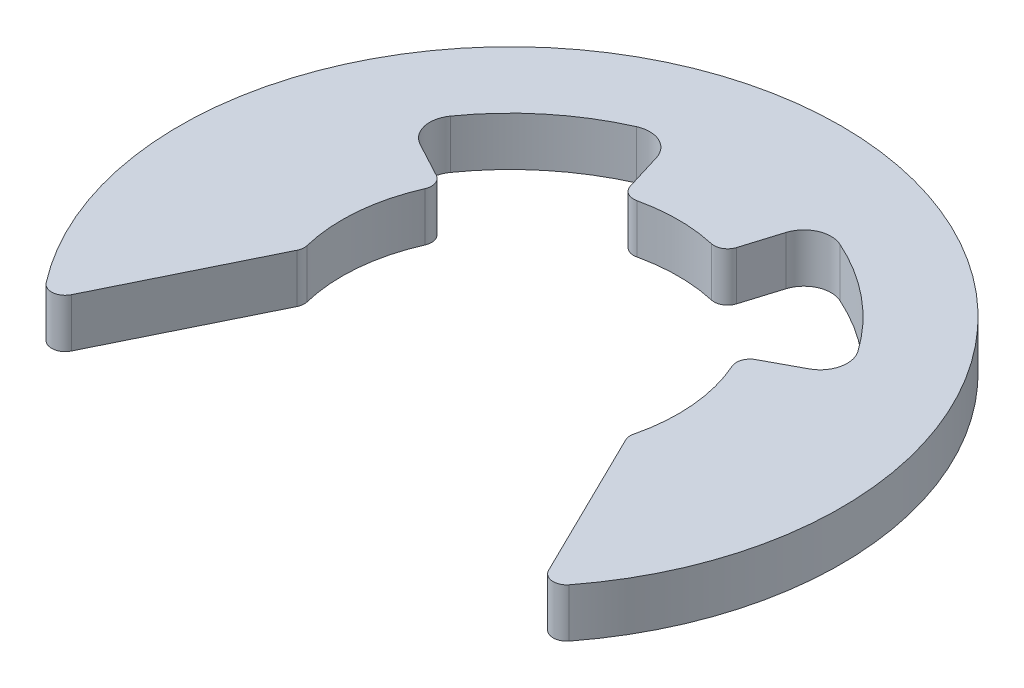
ISO-10303-21;
HEADER;
FILE_DESCRIPTION(('STEP AP214'),'2;1');
FILE_NAME('part.step','',(''),(''),'','','');
FILE_SCHEMA(('AUTOMOTIVE_DESIGN { 1 0 10303 214 1 1 1 1 }'));
ENDSEC;
DATA;
#1=APPLICATION_CONTEXT('core data for automotive mechanical design processes');
#2=APPLICATION_PROTOCOL_DEFINITION('international standard','automotive_design',2000,#1);
#3=PRODUCT_CONTEXT('',#1,'mechanical');
#4=PRODUCT('Part','Part','',(#3));
#5=PRODUCT_RELATED_PRODUCT_CATEGORY('part','',(#4));
#6=PRODUCT_DEFINITION_FORMATION('','',#4);
#7=PRODUCT_DEFINITION_CONTEXT('part definition',#1,'design');
#8=PRODUCT_DEFINITION('design','',#6,#7);
#9=PRODUCT_DEFINITION_SHAPE('','',#8);
#10=(LENGTH_UNIT() NAMED_UNIT(*) SI_UNIT(.MILLI.,.METRE.));
#11=(NAMED_UNIT(*) PLANE_ANGLE_UNIT() SI_UNIT($,.RADIAN.));
#12=(NAMED_UNIT(*) SI_UNIT($,.STERADIAN.) SOLID_ANGLE_UNIT());
#13=UNCERTAINTY_MEASURE_WITH_UNIT(LENGTH_MEASURE(1.E-05),#10,'distance_accuracy_value','');
#14=(GEOMETRIC_REPRESENTATION_CONTEXT(3) GLOBAL_UNCERTAINTY_ASSIGNED_CONTEXT((#13)) GLOBAL_UNIT_ASSIGNED_CONTEXT((#10,
#11,#12)) REPRESENTATION_CONTEXT('',''));
#15=CARTESIAN_POINT('',(0.,0.,0.));
#16=DIRECTION('',(0.,0.,1.));
#17=DIRECTION('',(1.,0.,0.));
#18=AXIS2_PLACEMENT_3D('',#15,#16,#17);
#19=CARTESIAN_POINT('',(-3.34958514140608,0.9,-2.3643771654437));
#20=DIRECTION('',(0.,-1.,0.));
#21=DIRECTION('',(0.,0.,-1.));
#22=AXIS2_PLACEMENT_3D('',#19,#20,#21);
#23=CYLINDRICAL_SURFACE('',#22,0.5);
#24=CARTESIAN_POINT('',(-3.34958514140608,0.,-2.3643771654437));
#25=DIRECTION('',(0.,-1.,0.));
#26=DIRECTION('',(0.,0.,-1.));
#27=AXIS2_PLACEMENT_3D('',#24,#25,#26);
#28=CIRCLE('',#27,0.5);
#29=CARTESIAN_POINT('',(-3.58595632265713,0.,-1.92377681969488));
#30=VERTEX_POINT('',#29);
#31=CARTESIAN_POINT('',(-3.75807113426048,0.,-2.65271584415635));
#32=VERTEX_POINT('',#31);
#33=EDGE_CURVE('E224',#30,#32,#28,.T.);
#34=ORIENTED_EDGE('',*,*,#33,.T.);
#35=DIRECTION('',(0.,-1.,0.));
#36=VECTOR('',#35,1.);
#37=CARTESIAN_POINT('',(-3.75807113426048,0.9,-2.65271584415635));
#38=LINE('',#37,#36);
#39=CARTESIAN_POINT('',(-3.75807113426048,0.9,-2.65271584415635));
#40=VERTEX_POINT('',#39);
#41=EDGE_CURVE('E11',#40,#32,#38,.T.);
#42=ORIENTED_EDGE('',*,*,#41,.F.);
#43=CARTESIAN_POINT('',(-3.34958514140608,0.9,-2.3643771654437));
#44=DIRECTION('',(0.,-1.,0.));
#45=DIRECTION('',(0.,0.,-1.));
#46=AXIS2_PLACEMENT_3D('',#43,#44,#45);
#47=CIRCLE('',#46,0.5);
#48=CARTESIAN_POINT('',(-3.58595632265713,0.9,-1.92377681969488));
#49=VERTEX_POINT('',#48);
#50=EDGE_CURVE('E270',#49,#40,#47,.T.);
#51=ORIENTED_EDGE('',*,*,#50,.F.);
#52=DIRECTION('',(0.,-1.,0.));
#53=VECTOR('',#52,1.);
#54=CARTESIAN_POINT('',(-3.58595632265713,0.9,-1.92377681969488));
#55=LINE('',#54,#53);
#56=EDGE_CURVE('E220',#49,#30,#55,.T.);
#57=ORIENTED_EDGE('',*,*,#56,.T.);
#58=EDGE_LOOP('',(#34,#42,#51,#57));
#59=FACE_BOUND('',#58,.T.);
#60=ADVANCED_FACE('F32',(#59),#23,.F.);
#61=CARTESIAN_POINT('',(0.,0.9,0.));
#62=DIRECTION('',(0.,-1.,0.));
#63=DIRECTION('',(0.,0.,-1.));
#64=AXIS2_PLACEMENT_3D('',#61,#62,#63);
#65=CYLINDRICAL_SURFACE('',#64,4.6);
#66=CARTESIAN_POINT('',(0.,0.,0.));
#67=DIRECTION('',(0.,-1.,0.));
#68=DIRECTION('',(0.,0.,1.));
#69=AXIS2_PLACEMENT_3D('',#66,#67,#68);
#70=CIRCLE('',#69,4.6);
#71=CARTESIAN_POINT('',(-1.87619719648438,0.,-4.19998619996592));
#72=VERTEX_POINT('',#71);
#73=EDGE_CURVE('E227',#32,#72,#70,.T.);
#74=ORIENTED_EDGE('',*,*,#73,.T.);
#75=DIRECTION('',(0.,-1.,0.));
#76=VECTOR('',#75,1.);
#77=CARTESIAN_POINT('',(-1.87619719648438,0.9,-4.19998619996592));
#78=LINE('',#77,#76);
#79=CARTESIAN_POINT('',(-1.87619719648438,0.9,-4.19998619996592));
#80=VERTEX_POINT('',#79);
#81=EDGE_CURVE('E40',#80,#72,#78,.T.);
#82=ORIENTED_EDGE('',*,*,#81,.F.);
#83=CARTESIAN_POINT('',(0.,0.9,0.));
#84=DIRECTION('',(0.,-1.,0.));
#85=DIRECTION('',(0.,0.,1.));
#86=AXIS2_PLACEMENT_3D('',#83,#84,#85);
#87=CIRCLE('',#86,4.6);
#88=EDGE_CURVE('E139',#40,#80,#87,.T.);
#89=ORIENTED_EDGE('',*,*,#88,.F.);
#90=ORIENTED_EDGE('',*,*,#41,.T.);
#91=EDGE_LOOP('',(#74,#82,#89,#90));
#92=FACE_BOUND('',#91,.T.);
#93=ADVANCED_FACE('F408',(#92),#65,.F.);
#94=CARTESIAN_POINT('',(-1.67226271860565,0.9,-3.74346596083919));
#95=DIRECTION('',(0.,-1.,0.));
#96=DIRECTION('',(0.,0.,-1.));
#97=AXIS2_PLACEMENT_3D('',#94,#95,#96);
#98=CYLINDRICAL_SURFACE('',#97,0.5);
#99=CARTESIAN_POINT('',(-1.67226271860565,0.,-3.74346596083919));
#100=DIRECTION('',(0.,-1.,0.));
#101=DIRECTION('',(0.,0.,1.));
#102=AXIS2_PLACEMENT_3D('',#99,#100,#101);
#103=CIRCLE('',#102,0.5);
#104=CARTESIAN_POINT('',(-1.19427984485467,0.,-3.89020509127397));
#105=VERTEX_POINT('',#104);
#106=EDGE_CURVE('E229',#72,#105,#103,.T.);
#107=ORIENTED_EDGE('',*,*,#106,.T.);
#108=DIRECTION('',(0.,-1.,0.));
#109=VECTOR('',#108,1.);
#110=CARTESIAN_POINT('',(-1.19427984485467,0.9,-3.89020509127397));
#111=LINE('',#110,#109);
#112=CARTESIAN_POINT('',(-1.19427984485467,0.9,-3.89020509127397));
#113=VERTEX_POINT('',#112);
#114=EDGE_CURVE('E325',#113,#105,#111,.T.);
#115=ORIENTED_EDGE('',*,*,#114,.F.);
#116=CARTESIAN_POINT('',(-1.67226271860565,0.9,-3.74346596083919));
#117=DIRECTION('',(0.,-1.,0.));
#118=DIRECTION('',(0.,0.,1.));
#119=AXIS2_PLACEMENT_3D('',#116,#117,#118);
#120=CIRCLE('',#119,0.5);
#121=EDGE_CURVE('E333',#80,#113,#120,.T.);
#122=ORIENTED_EDGE('',*,*,#121,.F.);
#123=ORIENTED_EDGE('',*,*,#81,.T.);
#124=EDGE_LOOP('',(#107,#115,#122,#123));
#125=FACE_BOUND('',#124,.T.);
#126=ADVANCED_FACE('F331',(#125),#98,.F.);
#127=CARTESIAN_POINT('',(-0.980410681280938,0.9,-3.19355521261653));
#128=DIRECTION('',(0.955965747501957,0.,-0.293478260869565));
#129=DIRECTION('',(-0.293478260869565,0.,-0.955965747501957));
#130=AXIS2_PLACEMENT_3D('',#127,#128,#129);
#131=PLANE('',#130);
#132=DIRECTION('',(0.293478260869565,0.,0.955965747501957));
#133=VECTOR('',#132,1.);
#134=CARTESIAN_POINT('',(-0.980410681280938,0.,-3.19355521261653));
#135=LINE('',#134,#133);
#136=CARTESIAN_POINT('',(-0.980410681280938,0.,-3.19355521261653));
#137=VERTEX_POINT('',#136);
#138=EDGE_CURVE('E231',#105,#137,#135,.T.);
#139=ORIENTED_EDGE('',*,*,#138,.T.);
#140=DIRECTION('',(0.,-1.,0.));
#141=VECTOR('',#140,1.);
#142=CARTESIAN_POINT('',(-0.980410681280938,0.9,-3.19355521261653));
#143=LINE('',#142,#141);
#144=CARTESIAN_POINT('',(-0.980410681280938,0.9,-3.19355521261653));
#145=VERTEX_POINT('',#144);
#146=EDGE_CURVE('E322',#145,#137,#143,.T.);
#147=ORIENTED_EDGE('',*,*,#146,.F.);
#148=DIRECTION('',(0.293478260869565,0.,0.955965747501957));
#149=VECTOR('',#148,1.);
#150=CARTESIAN_POINT('',(-0.980410681280938,0.9,-3.19355521261653));
#151=LINE('',#150,#149);
#152=EDGE_CURVE('E351',#113,#145,#151,.T.);
#153=ORIENTED_EDGE('',*,*,#152,.F.);
#154=ORIENTED_EDGE('',*,*,#114,.T.);
#155=EDGE_LOOP('',(#139,#147,#153,#154));
#156=FACE_BOUND('',#155,.T.);
#157=ADVANCED_FACE('F342',(#156),#131,.F.);
#158=CARTESIAN_POINT('',(-0.741419244405449,0.9,-3.26692477783393));
#159=DIRECTION('',(0.,-1.,0.));
#160=DIRECTION('',(0.,0.,-1.));
#161=AXIS2_PLACEMENT_3D('',#158,#159,#160);
#162=CYLINDRICAL_SURFACE('',#161,0.25);
#163=CARTESIAN_POINT('',(-0.741419244405449,0.,-3.26692477783393));
#164=DIRECTION('',(0.,1.,0.));
#165=DIRECTION('',(0.,0.,1.));
#166=AXIS2_PLACEMENT_3D('',#163,#164,#165);
#167=CIRCLE('',#166,0.25);
#168=CARTESIAN_POINT('',(-0.686089450046832,0.,-3.02312442127916));
#169=VERTEX_POINT('',#168);
#170=EDGE_CURVE('E233',#137,#169,#167,.T.);
#171=ORIENTED_EDGE('',*,*,#170,.T.);
#172=DIRECTION('',(0.,-1.,0.));
#173=VECTOR('',#172,1.);
#174=CARTESIAN_POINT('',(-0.686089450046832,0.9,-3.02312442127916));
#175=LINE('',#174,#173);
#176=CARTESIAN_POINT('',(-0.686089450046832,0.9,-3.02312442127916));
#177=VERTEX_POINT('',#176);
#178=EDGE_CURVE('E319',#177,#169,#175,.T.);
#179=ORIENTED_EDGE('',*,*,#178,.F.);
#180=CARTESIAN_POINT('',(-0.741419244405449,0.9,-3.26692477783393));
#181=DIRECTION('',(0.,1.,0.));
#182=DIRECTION('',(0.,0.,1.));
#183=AXIS2_PLACEMENT_3D('',#180,#181,#182);
#184=CIRCLE('',#183,0.25);
#185=EDGE_CURVE('E348',#145,#177,#184,.T.);
#186=ORIENTED_EDGE('',*,*,#185,.F.);
#187=ORIENTED_EDGE('',*,*,#146,.T.);
#188=EDGE_LOOP('',(#171,#179,#186,#187));
#189=FACE_BOUND('',#188,.T.);
#190=ADVANCED_FACE('F346',(#189),#162,.T.);
#191=CARTESIAN_POINT('',(0.,0.9,0.));
#192=DIRECTION('',(0.,-1.,0.));
#193=DIRECTION('',(0.,0.,-1.));
#194=AXIS2_PLACEMENT_3D('',#191,#192,#193);
#195=CYLINDRICAL_SURFACE('',#194,3.1);
#196=CARTESIAN_POINT('',(0.,0.,0.));
#197=DIRECTION('',(0.,-1.,0.));
#198=DIRECTION('',(0.,0.,1.));
#199=AXIS2_PLACEMENT_3D('',#196,#197,#198);
#200=CIRCLE('',#199,3.1);
#201=CARTESIAN_POINT('',(0.686089450046834,0.,-3.02312442127916));
#202=VERTEX_POINT('',#201);
#203=EDGE_CURVE('E235',#169,#202,#200,.T.);
#204=ORIENTED_EDGE('',*,*,#203,.T.);
#205=DIRECTION('',(0.,-1.,0.));
#206=VECTOR('',#205,1.);
#207=CARTESIAN_POINT('',(0.686089450046834,0.9,-3.02312442127916));
#208=LINE('',#207,#206);
#209=CARTESIAN_POINT('',(0.686089450046834,0.9,-3.02312442127916));
#210=VERTEX_POINT('',#209);
#211=EDGE_CURVE('E316',#210,#202,#208,.T.);
#212=ORIENTED_EDGE('',*,*,#211,.F.);
#213=CARTESIAN_POINT('',(0.,0.9,0.));
#214=DIRECTION('',(0.,-1.,0.));
#215=DIRECTION('',(0.,0.,1.));
#216=AXIS2_PLACEMENT_3D('',#213,#214,#215);
#217=CIRCLE('',#216,3.1);
#218=EDGE_CURVE('E350',#177,#210,#217,.T.);
#219=ORIENTED_EDGE('',*,*,#218,.F.);
#220=ORIENTED_EDGE('',*,*,#178,.T.);
#221=EDGE_LOOP('',(#204,#212,#219,#220));
#222=FACE_BOUND('',#221,.T.);
#223=ADVANCED_FACE('F421',(#222),#195,.F.);
#224=CARTESIAN_POINT('',(0.741419244405449,0.9,-3.26692477783393));
#225=DIRECTION('',(0.,-1.,0.));
#226=DIRECTION('',(0.,0.,-1.));
#227=AXIS2_PLACEMENT_3D('',#224,#225,#226);
#228=CYLINDRICAL_SURFACE('',#227,0.25);
#229=CARTESIAN_POINT('',(0.741419244405449,0.,-3.26692477783393));
#230=DIRECTION('',(0.,1.,0.));
#231=DIRECTION('',(0.,0.,-1.));
#232=AXIS2_PLACEMENT_3D('',#229,#230,#231);
#233=CIRCLE('',#232,0.25);
#234=CARTESIAN_POINT('',(0.980410681280938,0.,-3.19355521261653));
#235=VERTEX_POINT('',#234);
#236=EDGE_CURVE('E237',#202,#235,#233,.T.);
#237=ORIENTED_EDGE('',*,*,#236,.T.);
#238=DIRECTION('',(0.,-1.,0.));
#239=VECTOR('',#238,1.);
#240=CARTESIAN_POINT('',(0.980410681280938,0.9,-3.19355521261653));
#241=LINE('',#240,#239);
#242=CARTESIAN_POINT('',(0.980410681280938,0.9,-3.19355521261653));
#243=VERTEX_POINT('',#242);
#244=EDGE_CURVE('E313',#243,#235,#241,.T.);
#245=ORIENTED_EDGE('',*,*,#244,.F.);
#246=CARTESIAN_POINT('',(0.741419244405449,0.9,-3.26692477783393));
#247=DIRECTION('',(0.,1.,0.));
#248=DIRECTION('',(0.,0.,-1.));
#249=AXIS2_PLACEMENT_3D('',#246,#247,#248);
#250=CIRCLE('',#249,0.25);
#251=EDGE_CURVE('E353',#210,#243,#250,.T.);
#252=ORIENTED_EDGE('',*,*,#251,.F.);
#253=ORIENTED_EDGE('',*,*,#211,.T.);
#254=EDGE_LOOP('',(#237,#245,#252,#253));
#255=FACE_BOUND('',#254,.T.);
#256=ADVANCED_FACE('F424',(#255),#228,.T.);
#257=CARTESIAN_POINT('',(1.19427984485467,0.9,-3.89020509127397));
#258=DIRECTION('',(-0.955965747501957,0.,-0.293478260869565));
#259=DIRECTION('',(-0.293478260869565,0.,0.955965747501957));
#260=AXIS2_PLACEMENT_3D('',#257,#258,#259);
#261=PLANE('',#260);
#262=DIRECTION('',(0.293478260869565,0.,-0.955965747501957));
#263=VECTOR('',#262,1.);
#264=CARTESIAN_POINT('',(1.19427984485467,0.,-3.89020509127397));
#265=LINE('',#264,#263);
#266=CARTESIAN_POINT('',(1.19427984485467,0.,-3.89020509127397));
#267=VERTEX_POINT('',#266);
#268=EDGE_CURVE('E239',#235,#267,#265,.T.);
#269=ORIENTED_EDGE('',*,*,#268,.T.);
#270=DIRECTION('',(0.,-1.,0.));
#271=VECTOR('',#270,1.);
#272=CARTESIAN_POINT('',(1.19427984485467,0.9,-3.89020509127397));
#273=LINE('',#272,#271);
#274=CARTESIAN_POINT('',(1.19427984485467,0.9,-3.89020509127397));
#275=VERTEX_POINT('',#274);
#276=EDGE_CURVE('E310',#275,#267,#273,.T.);
#277=ORIENTED_EDGE('',*,*,#276,.F.);
#278=DIRECTION('',(0.293478260869565,0.,-0.955965747501957));
#279=VECTOR('',#278,1.);
#280=CARTESIAN_POINT('',(1.19427984485467,0.9,-3.89020509127397));
#281=LINE('',#280,#279);
#282=EDGE_CURVE('E359',#243,#275,#281,.T.);
#283=ORIENTED_EDGE('',*,*,#282,.F.);
#284=ORIENTED_EDGE('',*,*,#244,.T.);
#285=EDGE_LOOP('',(#269,#277,#283,#284));
#286=FACE_BOUND('',#285,.T.);
#287=ADVANCED_FACE('F428',(#286),#261,.F.);
#288=CARTESIAN_POINT('',(1.67226271860565,0.9,-3.74346596083919));
#289=DIRECTION('',(0.,-1.,0.));
#290=DIRECTION('',(0.,0.,-1.));
#291=AXIS2_PLACEMENT_3D('',#288,#289,#290);
#292=CYLINDRICAL_SURFACE('',#291,0.5);
#293=CARTESIAN_POINT('',(1.67226271860565,0.,-3.74346596083919));
#294=DIRECTION('',(0.,-1.,0.));
#295=DIRECTION('',(0.,0.,-1.));
#296=AXIS2_PLACEMENT_3D('',#293,#294,#295);
#297=CIRCLE('',#296,0.5);
#298=CARTESIAN_POINT('',(1.87619719648438,0.,-4.19998619996592));
#299=VERTEX_POINT('',#298);
#300=EDGE_CURVE('E241',#267,#299,#297,.T.);
#301=ORIENTED_EDGE('',*,*,#300,.T.);
#302=DIRECTION('',(0.,-1.,0.));
#303=VECTOR('',#302,1.);
#304=CARTESIAN_POINT('',(1.87619719648438,0.9,-4.19998619996592));
#305=LINE('',#304,#303);
#306=CARTESIAN_POINT('',(1.87619719648438,0.9,-4.19998619996592));
#307=VERTEX_POINT('',#306);
#308=EDGE_CURVE('E307',#307,#299,#305,.T.);
#309=ORIENTED_EDGE('',*,*,#308,.F.);
#310=CARTESIAN_POINT('',(1.67226271860565,0.9,-3.74346596083919));
#311=DIRECTION('',(0.,-1.,0.));
#312=DIRECTION('',(0.,0.,-1.));
#313=AXIS2_PLACEMENT_3D('',#310,#311,#312);
#314=CIRCLE('',#313,0.5);
#315=EDGE_CURVE('E361',#275,#307,#314,.T.);
#316=ORIENTED_EDGE('',*,*,#315,.F.);
#317=ORIENTED_EDGE('',*,*,#276,.T.);
#318=EDGE_LOOP('',(#301,#309,#316,#317));
#319=FACE_BOUND('',#318,.T.);
#320=ADVANCED_FACE('F432',(#319),#292,.F.);
#321=CARTESIAN_POINT('',(0.,0.9,0.));
#322=DIRECTION('',(0.,-1.,0.));
#323=DIRECTION('',(0.,0.,-1.));
#324=AXIS2_PLACEMENT_3D('',#321,#322,#323);
#325=CYLINDRICAL_SURFACE('',#324,4.6);
#326=CARTESIAN_POINT('',(0.,0.,0.));
#327=DIRECTION('',(0.,-1.,0.));
#328=DIRECTION('',(0.,0.,1.));
#329=AXIS2_PLACEMENT_3D('',#326,#327,#328);
#330=CIRCLE('',#329,4.6);
#331=CARTESIAN_POINT('',(3.75807113426048,0.,-2.65271584415635));
#332=VERTEX_POINT('',#331);
#333=EDGE_CURVE('E243',#299,#332,#330,.T.);
#334=ORIENTED_EDGE('',*,*,#333,.T.);
#335=DIRECTION('',(0.,-1.,0.));
#336=VECTOR('',#335,1.);
#337=CARTESIAN_POINT('',(3.75807113426048,0.9,-2.65271584415635));
#338=LINE('',#337,#336);
#339=CARTESIAN_POINT('',(3.75807113426048,0.9,-2.65271584415635));
#340=VERTEX_POINT('',#339);
#341=EDGE_CURVE('E304',#340,#332,#338,.T.);
#342=ORIENTED_EDGE('',*,*,#341,.F.);
#343=CARTESIAN_POINT('',(0.,0.9,0.));
#344=DIRECTION('',(0.,-1.,0.));
#345=DIRECTION('',(0.,0.,1.));
#346=AXIS2_PLACEMENT_3D('',#343,#344,#345);
#347=CIRCLE('',#346,4.6);
#348=EDGE_CURVE('E363',#307,#340,#347,.T.);
#349=ORIENTED_EDGE('',*,*,#348,.F.);
#350=ORIENTED_EDGE('',*,*,#308,.T.);
#351=EDGE_LOOP('',(#334,#342,#349,#350));
#352=FACE_BOUND('',#351,.T.);
#353=ADVANCED_FACE('F436',(#352),#325,.F.);
#354=CARTESIAN_POINT('',(3.34958514140608,0.9,-2.3643771654437));
#355=DIRECTION('',(0.,-1.,0.));
#356=DIRECTION('',(0.,0.,-1.));
#357=AXIS2_PLACEMENT_3D('',#354,#355,#356);
#358=CYLINDRICAL_SURFACE('',#357,0.5);
#359=CARTESIAN_POINT('',(3.34958514140608,0.,-2.3643771654437));
#360=DIRECTION('',(0.,-1.,0.));
#361=DIRECTION('',(0.,0.,1.));
#362=AXIS2_PLACEMENT_3D('',#359,#360,#361);
#363=CIRCLE('',#362,0.5);
#364=CARTESIAN_POINT('',(3.58595632265713,0.,-1.92377681969488));
#365=VERTEX_POINT('',#364);
#366=EDGE_CURVE('E245',#332,#365,#363,.T.);
#367=ORIENTED_EDGE('',*,*,#366,.T.);
#368=DIRECTION('',(0.,-1.,0.));
#369=VECTOR('',#368,1.);
#370=CARTESIAN_POINT('',(3.58595632265713,0.9,-1.92377681969488));
#371=LINE('',#370,#369);
#372=CARTESIAN_POINT('',(3.58595632265713,0.9,-1.92377681969488));
#373=VERTEX_POINT('',#372);
#374=EDGE_CURVE('E301',#373,#365,#371,.T.);
#375=ORIENTED_EDGE('',*,*,#374,.F.);
#376=CARTESIAN_POINT('',(3.34958514140608,0.9,-2.3643771654437));
#377=DIRECTION('',(0.,-1.,0.));
#378=DIRECTION('',(0.,0.,1.));
#379=AXIS2_PLACEMENT_3D('',#376,#377,#378);
#380=CIRCLE('',#379,0.5);
#381=EDGE_CURVE('E365',#340,#373,#380,.T.);
#382=ORIENTED_EDGE('',*,*,#381,.F.);
#383=ORIENTED_EDGE('',*,*,#341,.T.);
#384=EDGE_LOOP('',(#367,#375,#382,#383));
#385=FACE_BOUND('',#384,.T.);
#386=ADVANCED_FACE('F440',(#385),#358,.F.);
#387=CARTESIAN_POINT('',(2.94379068397307,0.9,-1.57927084724356));
#388=DIRECTION('',(0.472742362502099,0.,0.881200691497648));
#389=DIRECTION('',(0.881200691497648,0.,-0.472742362502099));
#390=AXIS2_PLACEMENT_3D('',#387,#388,#389);
#391=PLANE('',#390);
#392=DIRECTION('',(-0.881200691497648,0.,0.472742362502099));
#393=VECTOR('',#392,1.);
#394=CARTESIAN_POINT('',(2.94379068397307,0.,-1.57927084724356));
#395=LINE('',#394,#393);
#396=CARTESIAN_POINT('',(2.94379068397307,0.,-1.57927084724356));
#397=VERTEX_POINT('',#396);
#398=EDGE_CURVE('E247',#365,#397,#395,.T.);
#399=ORIENTED_EDGE('',*,*,#398,.T.);
#400=DIRECTION('',(0.,-1.,0.));
#401=VECTOR('',#400,1.);
#402=CARTESIAN_POINT('',(2.94379068397307,0.9,-1.57927084724356));
#403=LINE('',#402,#401);
#404=CARTESIAN_POINT('',(2.94379068397307,0.9,-1.57927084724356));
#405=VERTEX_POINT('',#404);
#406=EDGE_CURVE('E298',#405,#397,#403,.T.);
#407=ORIENTED_EDGE('',*,*,#406,.F.);
#408=DIRECTION('',(-0.881200691497648,0.,0.472742362502099));
#409=VECTOR('',#408,1.);
#410=CARTESIAN_POINT('',(2.94379068397307,0.9,-1.57927084724356));
#411=LINE('',#410,#409);
#412=EDGE_CURVE('E367',#373,#405,#411,.T.);
#413=ORIENTED_EDGE('',*,*,#412,.F.);
#414=ORIENTED_EDGE('',*,*,#374,.T.);
#415=EDGE_LOOP('',(#399,#407,#413,#414));
#416=FACE_BOUND('',#415,.T.);
#417=ADVANCED_FACE('F444',(#416),#391,.F.);
#418=CARTESIAN_POINT('',(3.06197627459859,0.9,-1.35897067436914));
#419=DIRECTION('',(0.,-1.,0.));
#420=DIRECTION('',(0.,0.,-1.));
#421=AXIS2_PLACEMENT_3D('',#418,#419,#420);
#422=CYLINDRICAL_SURFACE('',#421,0.249999999999999);
#423=CARTESIAN_POINT('',(3.06197627459859,0.,-1.35897067436914));
#424=DIRECTION('',(0.,1.,0.));
#425=DIRECTION('',(0.,0.,1.));
#426=AXIS2_PLACEMENT_3D('',#423,#424,#425);
#427=CIRCLE('',#426,0.249999999999999);
#428=CARTESIAN_POINT('',(2.83347058246437,0.,-1.2575549524013));
#429=VERTEX_POINT('',#428);
#430=EDGE_CURVE('E249',#397,#429,#427,.T.);
#431=ORIENTED_EDGE('',*,*,#430,.T.);
#432=DIRECTION('',(0.,-1.,0.));
#433=VECTOR('',#432,1.);
#434=CARTESIAN_POINT('',(2.83347058246437,0.9,-1.2575549524013));
#435=LINE('',#434,#433);
#436=CARTESIAN_POINT('',(2.83347058246437,0.9,-1.2575549524013));
#437=VERTEX_POINT('',#436);
#438=EDGE_CURVE('E295',#437,#429,#435,.T.);
#439=ORIENTED_EDGE('',*,*,#438,.F.);
#440=CARTESIAN_POINT('',(3.06197627459859,0.9,-1.35897067436914));
#441=DIRECTION('',(0.,1.,0.));
#442=DIRECTION('',(0.,0.,1.));
#443=AXIS2_PLACEMENT_3D('',#440,#441,#442);
#444=CIRCLE('',#443,0.249999999999999);
#445=EDGE_CURVE('E369',#405,#437,#444,.T.);
#446=ORIENTED_EDGE('',*,*,#445,.F.);
#447=ORIENTED_EDGE('',*,*,#406,.T.);
#448=EDGE_LOOP('',(#431,#439,#446,#447));
#449=FACE_BOUND('',#448,.T.);
#450=ADVANCED_FACE('F448',(#449),#422,.T.);
#451=CARTESIAN_POINT('',(0.,0.9,0.));
#452=DIRECTION('',(0.,-1.,0.));
#453=DIRECTION('',(0.,0.,-1.));
#454=AXIS2_PLACEMENT_3D('',#451,#452,#453);
#455=CYLINDRICAL_SURFACE('',#454,3.1);
#456=CARTESIAN_POINT('',(0.,0.,0.));
#457=DIRECTION('',(0.,-1.,0.));
#458=DIRECTION('',(0.,0.,1.));
#459=AXIS2_PLACEMENT_3D('',#456,#457,#458);
#460=CIRCLE('',#459,3.1);
#461=CARTESIAN_POINT('',(3.01190688096238,0.,0.733768996627342));
#462=VERTEX_POINT('',#461);
#463=EDGE_CURVE('E251',#429,#462,#460,.T.);
#464=ORIENTED_EDGE('',*,*,#463,.T.);
#465=DIRECTION('',(0.,-1.,0.));
#466=VECTOR('',#465,1.);
#467=CARTESIAN_POINT('',(3.01190688096238,0.9,0.733768996627342));
#468=LINE('',#467,#466);
#469=CARTESIAN_POINT('',(3.01190688096238,0.9,0.733768996627342));
#470=VERTEX_POINT('',#469);
#471=EDGE_CURVE('E292',#470,#462,#468,.T.);
#472=ORIENTED_EDGE('',*,*,#471,.F.);
#473=CARTESIAN_POINT('',(0.,0.9,0.));
#474=DIRECTION('',(0.,-1.,0.));
#475=DIRECTION('',(0.,0.,1.));
#476=AXIS2_PLACEMENT_3D('',#473,#474,#475);
#477=CIRCLE('',#476,3.1);
#478=EDGE_CURVE('E371',#437,#470,#477,.T.);
#479=ORIENTED_EDGE('',*,*,#478,.F.);
#480=ORIENTED_EDGE('',*,*,#438,.T.);
#481=EDGE_LOOP('',(#464,#472,#479,#480));
#482=FACE_BOUND('',#481,.T.);
#483=ADVANCED_FACE('F452',(#482),#455,.F.);
#484=CARTESIAN_POINT('',(3.25480259716902,0.9,0.792943915710193));
#485=DIRECTION('',(0.,-1.,0.));
#486=DIRECTION('',(0.,0.,-1.));
#487=AXIS2_PLACEMENT_3D('',#484,#485,#486);
#488=CYLINDRICAL_SURFACE('',#487,0.25);
#489=CARTESIAN_POINT('',(3.25480259716902,0.,0.792943915710193));
#490=DIRECTION('',(0.,1.,0.));
#491=DIRECTION('',(0.,0.,-1.));
#492=AXIS2_PLACEMENT_3D('',#489,#490,#491);
#493=CIRCLE('',#492,0.25);
#494=CARTESIAN_POINT('',(3.03038768942599,0.,0.903116276956955));
#495=VERTEX_POINT('',#494);
#496=EDGE_CURVE('E253',#462,#495,#493,.T.);
#497=ORIENTED_EDGE('',*,*,#496,.T.);
#498=DIRECTION('',(0.,-1.,0.));
#499=VECTOR('',#498,1.);
#500=CARTESIAN_POINT('',(3.03038768942599,0.9,0.903116276956955));
#501=LINE('',#500,#499);
#502=CARTESIAN_POINT('',(3.03038768942599,0.9,0.903116276956955));
#503=VERTEX_POINT('',#502);
#504=EDGE_CURVE('E289',#503,#495,#501,.T.);
#505=ORIENTED_EDGE('',*,*,#504,.F.);
#506=CARTESIAN_POINT('',(3.25480259716902,0.9,0.792943915710193));
#507=DIRECTION('',(0.,1.,0.));
#508=DIRECTION('',(0.,0.,-1.));
#509=AXIS2_PLACEMENT_3D('',#506,#507,#508);
#510=CIRCLE('',#509,0.25);
#511=EDGE_CURVE('E373',#470,#503,#510,.T.);
#512=ORIENTED_EDGE('',*,*,#511,.F.);
#513=ORIENTED_EDGE('',*,*,#471,.T.);
#514=EDGE_LOOP('',(#497,#505,#512,#513));
#515=FACE_BOUND('',#514,.T.);
#516=ADVANCED_FACE('F456',(#515),#488,.T.);
#517=CARTESIAN_POINT('',(3.03038768942599,0.9,0.903116276956955));
#518=DIRECTION('',(0.897659630972122,0.,-0.44068944498705));
#519=DIRECTION('',(-0.44068944498705,0.,-0.897659630972122));
#520=AXIS2_PLACEMENT_3D('',#517,#518,#519);
#521=PLANE('',#520);
#522=DIRECTION('',(0.44068944498705,0.,0.897659630972122));
#523=VECTOR('',#522,1.);
#524=CARTESIAN_POINT('',(3.03038768942599,0.,0.903116276956955));
#525=LINE('',#524,#523);
#526=CARTESIAN_POINT('',(4.40004469919539,0.,3.69303062578849));
#527=VERTEX_POINT('',#526);
#528=EDGE_CURVE('E255',#495,#527,#525,.T.);
#529=ORIENTED_EDGE('',*,*,#528,.T.);
#530=DIRECTION('',(0.,-1.,0.));
#531=VECTOR('',#530,1.);
#532=CARTESIAN_POINT('',(4.40004469919539,0.9,3.69303062578849));
#533=LINE('',#532,#531);
#534=CARTESIAN_POINT('',(4.40004469919539,0.9,3.69303062578849));
#535=VERTEX_POINT('',#534);
#536=EDGE_CURVE('E286',#535,#527,#533,.T.);
#537=ORIENTED_EDGE('',*,*,#536,.F.);
#538=DIRECTION('',(0.44068944498705,0.,0.897659630972122));
#539=VECTOR('',#538,1.);
#540=CARTESIAN_POINT('',(3.03038768942599,0.9,0.903116276956955));
#541=LINE('',#540,#539);
#542=EDGE_CURVE('E375',#503,#535,#541,.T.);
#543=ORIENTED_EDGE('',*,*,#542,.F.);
#544=ORIENTED_EDGE('',*,*,#504,.T.);
#545=EDGE_LOOP('',(#529,#537,#543,#544));
#546=FACE_BOUND('',#545,.T.);
#547=ADVANCED_FACE('F460',(#546),#521,.F.);
#548=CARTESIAN_POINT('',(4.62445960693841,0.9,3.58285826454173));
#549=DIRECTION('',(0.,-1.,0.));
#550=DIRECTION('',(0.,0.,-1.));
#551=AXIS2_PLACEMENT_3D('',#548,#549,#550);
#552=CYLINDRICAL_SURFACE('',#551,0.25);
#553=CARTESIAN_POINT('',(4.62445960693841,0.,3.58285826454173));
#554=DIRECTION('',(0.,1.,0.));
#555=DIRECTION('',(0.,0.,1.));
#556=AXIS2_PLACEMENT_3D('',#553,#554,#555);
#557=CIRCLE('',#556,0.25);
#558=CARTESIAN_POINT('',(4.82208608586741,0.,3.73597186559052));
#559=VERTEX_POINT('',#558);
#560=EDGE_CURVE('E257',#527,#559,#557,.T.);
#561=ORIENTED_EDGE('',*,*,#560,.T.);
#562=DIRECTION('',(0.,-1.,0.));
#563=VECTOR('',#562,1.);
#564=CARTESIAN_POINT('',(4.82208608586741,0.9,3.73597186559052));
#565=LINE('',#564,#563);
#566=CARTESIAN_POINT('',(4.82208608586741,0.9,3.73597186559052));
#567=VERTEX_POINT('',#566);
#568=EDGE_CURVE('E283',#567,#559,#565,.T.);
#569=ORIENTED_EDGE('',*,*,#568,.F.);
#570=CARTESIAN_POINT('',(4.62445960693841,0.9,3.58285826454173));
#571=DIRECTION('',(0.,1.,0.));
#572=DIRECTION('',(0.,0.,1.));
#573=AXIS2_PLACEMENT_3D('',#570,#571,#572);
#574=CIRCLE('',#573,0.25);
#575=EDGE_CURVE('E377',#535,#567,#574,.T.);
#576=ORIENTED_EDGE('',*,*,#575,.F.);
#577=ORIENTED_EDGE('',*,*,#536,.T.);
#578=EDGE_LOOP('',(#561,#569,#576,#577));
#579=FACE_BOUND('',#578,.T.);
#580=ADVANCED_FACE('F464',(#579),#552,.T.);
#581=CARTESIAN_POINT('',(0.,0.9,0.));
#582=DIRECTION('',(0.,-1.,0.));
#583=DIRECTION('',(0.,0.,-1.));
#584=AXIS2_PLACEMENT_3D('',#581,#582,#583);
#585=CYLINDRICAL_SURFACE('',#584,6.1);
#586=CARTESIAN_POINT('',(0.,0.,0.));
#587=DIRECTION('',(0.,1.,0.));
#588=DIRECTION('',(0.,0.,1.));
#589=AXIS2_PLACEMENT_3D('',#586,#587,#588);
#590=CIRCLE('',#589,6.1);
#591=CARTESIAN_POINT('',(-4.82208608586741,0.,3.73597186559052));
#592=VERTEX_POINT('',#591);
#593=EDGE_CURVE('E259',#559,#592,#590,.T.);
#594=ORIENTED_EDGE('',*,*,#593,.T.);
#595=DIRECTION('',(0.,-1.,0.));
#596=VECTOR('',#595,1.);
#597=CARTESIAN_POINT('',(-4.82208608586741,0.9,3.73597186559052));
#598=LINE('',#597,#596);
#599=CARTESIAN_POINT('',(-4.82208608586741,0.9,3.73597186559052));
#600=VERTEX_POINT('',#599);
#601=EDGE_CURVE('E280',#600,#592,#598,.T.);
#602=ORIENTED_EDGE('',*,*,#601,.F.);
#603=CARTESIAN_POINT('',(0.,0.9,0.));
#604=DIRECTION('',(0.,1.,0.));
#605=DIRECTION('',(0.,0.,1.));
#606=AXIS2_PLACEMENT_3D('',#603,#604,#605);
#607=CIRCLE('',#606,6.1);
#608=EDGE_CURVE('E379',#567,#600,#607,.T.);
#609=ORIENTED_EDGE('',*,*,#608,.F.);
#610=ORIENTED_EDGE('',*,*,#568,.T.);
#611=EDGE_LOOP('',(#594,#602,#609,#610));
#612=FACE_BOUND('',#611,.T.);
#613=ADVANCED_FACE('F468',(#612),#585,.T.);
#614=CARTESIAN_POINT('',(-4.62445960693841,0.9,3.58285826454173));
#615=DIRECTION('',(0.,-1.,0.));
#616=DIRECTION('',(0.,0.,-1.));
#617=AXIS2_PLACEMENT_3D('',#614,#615,#616);
#618=CYLINDRICAL_SURFACE('',#617,0.25);
#619=CARTESIAN_POINT('',(-4.62445960693841,0.,3.58285826454173));
#620=DIRECTION('',(0.,1.,0.));
#621=DIRECTION('',(0.,0.,-1.));
#622=AXIS2_PLACEMENT_3D('',#619,#620,#621);
#623=CIRCLE('',#622,0.25);
#624=CARTESIAN_POINT('',(-4.40004469919539,0.,3.69303062578849));
#625=VERTEX_POINT('',#624);
#626=EDGE_CURVE('E261',#592,#625,#623,.T.);
#627=ORIENTED_EDGE('',*,*,#626,.T.);
#628=DIRECTION('',(0.,-1.,0.));
#629=VECTOR('',#628,1.);
#630=CARTESIAN_POINT('',(-4.40004469919539,0.9,3.69303062578849));
#631=LINE('',#630,#629);
#632=CARTESIAN_POINT('',(-4.40004469919539,0.9,3.69303062578849));
#633=VERTEX_POINT('',#632);
#634=EDGE_CURVE('E277',#633,#625,#631,.T.);
#635=ORIENTED_EDGE('',*,*,#634,.F.);
#636=CARTESIAN_POINT('',(-4.62445960693841,0.9,3.58285826454173));
#637=DIRECTION('',(0.,1.,0.));
#638=DIRECTION('',(0.,0.,-1.));
#639=AXIS2_PLACEMENT_3D('',#636,#637,#638);
#640=CIRCLE('',#639,0.25);
#641=EDGE_CURVE('E381',#600,#633,#640,.T.);
#642=ORIENTED_EDGE('',*,*,#641,.F.);
#643=ORIENTED_EDGE('',*,*,#601,.T.);
#644=EDGE_LOOP('',(#627,#635,#642,#643));
#645=FACE_BOUND('',#644,.T.);
#646=ADVANCED_FACE('F472',(#645),#618,.T.);
#647=CARTESIAN_POINT('',(-3.03038768942599,0.9,0.903116276956955));
#648=DIRECTION('',(-0.897659630972122,0.,-0.44068944498705));
#649=DIRECTION('',(-0.44068944498705,0.,0.897659630972122));
#650=AXIS2_PLACEMENT_3D('',#647,#648,#649);
#651=PLANE('',#650);
#652=DIRECTION('',(0.44068944498705,0.,-0.897659630972122));
#653=VECTOR('',#652,1.);
#654=CARTESIAN_POINT('',(-3.03038768942599,0.,0.903116276956955));
#655=LINE('',#654,#653);
#656=CARTESIAN_POINT('',(-3.03038768942599,0.,0.903116276956955));
#657=VERTEX_POINT('',#656);
#658=EDGE_CURVE('E263',#625,#657,#655,.T.);
#659=ORIENTED_EDGE('',*,*,#658,.T.);
#660=DIRECTION('',(0.,-1.,0.));
#661=VECTOR('',#660,1.);
#662=CARTESIAN_POINT('',(-3.03038768942599,0.9,0.903116276956955));
#663=LINE('',#662,#661);
#664=CARTESIAN_POINT('',(-3.03038768942599,0.9,0.903116276956955));
#665=VERTEX_POINT('',#664);
#666=EDGE_CURVE('E274',#665,#657,#663,.T.);
#667=ORIENTED_EDGE('',*,*,#666,.F.);
#668=DIRECTION('',(0.44068944498705,0.,-0.897659630972122));
#669=VECTOR('',#668,1.);
#670=CARTESIAN_POINT('',(-3.03038768942599,0.9,0.903116276956955));
#671=LINE('',#670,#669);
#672=EDGE_CURVE('E383',#633,#665,#671,.T.);
#673=ORIENTED_EDGE('',*,*,#672,.F.);
#674=ORIENTED_EDGE('',*,*,#634,.T.);
#675=EDGE_LOOP('',(#659,#667,#673,#674));
#676=FACE_BOUND('',#675,.T.);
#677=ADVANCED_FACE('F389',(#676),#651,.F.);
#678=CARTESIAN_POINT('',(-3.25480259716902,0.9,0.792943915710193));
#679=DIRECTION('',(0.,-1.,0.));
#680=DIRECTION('',(0.,0.,-1.));
#681=AXIS2_PLACEMENT_3D('',#678,#679,#680);
#682=CYLINDRICAL_SURFACE('',#681,0.25);
#683=CARTESIAN_POINT('',(-3.25480259716902,0.,0.792943915710193));
#684=DIRECTION('',(0.,1.,0.));
#685=DIRECTION('',(0.,0.,1.));
#686=AXIS2_PLACEMENT_3D('',#683,#684,#685);
#687=CIRCLE('',#686,0.25);
#688=CARTESIAN_POINT('',(-3.01190688096237,0.,0.733768996627342));
#689=VERTEX_POINT('',#688);
#690=EDGE_CURVE('E265',#657,#689,#687,.T.);
#691=ORIENTED_EDGE('',*,*,#690,.T.);
#692=DIRECTION('',(0.,-1.,0.));
#693=VECTOR('',#692,1.);
#694=CARTESIAN_POINT('',(-3.01190688096237,0.9,0.733768996627342));
#695=LINE('',#694,#693);
#696=CARTESIAN_POINT('',(-3.01190688096237,0.9,0.733768996627342));
#697=VERTEX_POINT('',#696);
#698=EDGE_CURVE('E215',#697,#689,#695,.T.);
#699=ORIENTED_EDGE('',*,*,#698,.F.);
#700=CARTESIAN_POINT('',(-3.25480259716902,0.9,0.792943915710193));
#701=DIRECTION('',(0.,1.,0.));
#702=DIRECTION('',(0.,0.,1.));
#703=AXIS2_PLACEMENT_3D('',#700,#701,#702);
#704=CIRCLE('',#703,0.25);
#705=EDGE_CURVE('E206',#665,#697,#704,.T.);
#706=ORIENTED_EDGE('',*,*,#705,.F.);
#707=ORIENTED_EDGE('',*,*,#666,.T.);
#708=EDGE_LOOP('',(#691,#699,#706,#707));
#709=FACE_BOUND('',#708,.T.);
#710=ADVANCED_FACE('F393',(#709),#682,.T.);
#711=CARTESIAN_POINT('',(0.,0.9,0.));
#712=DIRECTION('',(0.,-1.,0.));
#713=DIRECTION('',(0.,0.,-1.));
#714=AXIS2_PLACEMENT_3D('',#711,#712,#713);
#715=CYLINDRICAL_SURFACE('',#714,3.1);
#716=CARTESIAN_POINT('',(0.,0.,0.));
#717=DIRECTION('',(0.,-1.,0.));
#718=DIRECTION('',(0.,0.,1.));
#719=AXIS2_PLACEMENT_3D('',#716,#717,#718);
#720=CIRCLE('',#719,3.1);
#721=CARTESIAN_POINT('',(-2.83347058246437,0.,-1.2575549524013));
#722=VERTEX_POINT('',#721);
#723=EDGE_CURVE('E214',#689,#722,#720,.T.);
#724=ORIENTED_EDGE('',*,*,#723,.T.);
#725=DIRECTION('',(0.,-1.,0.));
#726=VECTOR('',#725,1.);
#727=CARTESIAN_POINT('',(-2.83347058246437,0.9,-1.2575549524013));
#728=LINE('',#727,#726);
#729=CARTESIAN_POINT('',(-2.83347058246437,0.9,-1.2575549524013));
#730=VERTEX_POINT('',#729);
#731=EDGE_CURVE('E211',#730,#722,#728,.T.);
#732=ORIENTED_EDGE('',*,*,#731,.F.);
#733=CARTESIAN_POINT('',(0.,0.9,0.));
#734=DIRECTION('',(0.,-1.,0.));
#735=DIRECTION('',(0.,0.,1.));
#736=AXIS2_PLACEMENT_3D('',#733,#734,#735);
#737=CIRCLE('',#736,3.1);
#738=EDGE_CURVE('E200',#697,#730,#737,.T.);
#739=ORIENTED_EDGE('',*,*,#738,.F.);
#740=ORIENTED_EDGE('',*,*,#698,.T.);
#741=EDGE_LOOP('',(#724,#732,#739,#740));
#742=FACE_BOUND('',#741,.T.);
#743=ADVANCED_FACE('F212',(#742),#715,.F.);
#744=CARTESIAN_POINT('',(-3.06197627459859,0.9,-1.35897067436914));
#745=DIRECTION('',(0.,-1.,0.));
#746=DIRECTION('',(0.,0.,-1.));
#747=AXIS2_PLACEMENT_3D('',#744,#745,#746);
#748=CYLINDRICAL_SURFACE('',#747,0.249999999999999);
#749=CARTESIAN_POINT('',(-3.06197627459859,0.,-1.35897067436914));
#750=DIRECTION('',(0.,1.,0.));
#751=DIRECTION('',(0.,0.,-1.));
#752=AXIS2_PLACEMENT_3D('',#749,#750,#751);
#753=CIRCLE('',#752,0.249999999999999);
#754=CARTESIAN_POINT('',(-2.94379068397307,0.,-1.57927084724356));
#755=VERTEX_POINT('',#754);
#756=EDGE_CURVE('E125',#722,#755,#753,.T.);
#757=ORIENTED_EDGE('',*,*,#756,.T.);
#758=DIRECTION('',(0.,-1.,0.));
#759=VECTOR('',#758,1.);
#760=CARTESIAN_POINT('',(-2.94379068397307,0.9,-1.57927084724356));
#761=LINE('',#760,#759);
#762=CARTESIAN_POINT('',(-2.94379068397307,0.9,-1.57927084724356));
#763=VERTEX_POINT('',#762);
#764=EDGE_CURVE('E216',#763,#755,#761,.T.);
#765=ORIENTED_EDGE('',*,*,#764,.F.);
#766=CARTESIAN_POINT('',(-3.06197627459859,0.9,-1.35897067436914));
#767=DIRECTION('',(0.,1.,0.));
#768=DIRECTION('',(0.,0.,-1.));
#769=AXIS2_PLACEMENT_3D('',#766,#767,#768);
#770=CIRCLE('',#769,0.249999999999999);
#771=EDGE_CURVE('E204',#730,#763,#770,.T.);
#772=ORIENTED_EDGE('',*,*,#771,.F.);
#773=ORIENTED_EDGE('',*,*,#731,.T.);
#774=EDGE_LOOP('',(#757,#765,#772,#773));
#775=FACE_BOUND('',#774,.T.);
#776=ADVANCED_FACE('F218',(#775),#748,.T.);
#777=CARTESIAN_POINT('',(-2.94379068397307,0.9,-1.57927084724356));
#778=DIRECTION('',(-0.472742362502099,0.,0.881200691497648));
#779=DIRECTION('',(0.881200691497648,0.,0.472742362502099));
#780=AXIS2_PLACEMENT_3D('',#777,#778,#779);
#781=PLANE('',#780);
#782=DIRECTION('',(-0.881200691497648,0.,-0.472742362502099));
#783=VECTOR('',#782,1.);
#784=CARTESIAN_POINT('',(-2.94379068397307,0.,-1.57927084724356));
#785=LINE('',#784,#783);
#786=EDGE_CURVE('E131',#755,#30,#785,.T.);
#787=ORIENTED_EDGE('',*,*,#786,.T.);
#788=ORIENTED_EDGE('',*,*,#56,.F.);
#789=DIRECTION('',(-0.881200691497648,0.,-0.472742362502099));
#790=VECTOR('',#789,1.);
#791=CARTESIAN_POINT('',(-2.94379068397307,0.9,-1.57927084724356));
#792=LINE('',#791,#790);
#793=EDGE_CURVE('E48',#763,#49,#792,.T.);
#794=ORIENTED_EDGE('',*,*,#793,.F.);
#795=ORIENTED_EDGE('',*,*,#764,.T.);
#796=EDGE_LOOP('',(#787,#788,#794,#795));
#797=FACE_BOUND('',#796,.T.);
#798=ADVANCED_FACE('F397',(#797),#781,.F.);
#799=CARTESIAN_POINT('',(-3.34958514140608,0.9,-2.3643771654437));
#800=DIRECTION('',(0.,-1.,0.));
#801=DIRECTION('',(0.,0.,-1.));
#802=AXIS2_PLACEMENT_3D('',#799,#800,#801);
#803=PLANE('',#802);
#804=ORIENTED_EDGE('',*,*,#50,.T.);
#805=ORIENTED_EDGE('',*,*,#88,.T.);
#806=ORIENTED_EDGE('',*,*,#121,.T.);
#807=ORIENTED_EDGE('',*,*,#152,.T.);
#808=ORIENTED_EDGE('',*,*,#185,.T.);
#809=ORIENTED_EDGE('',*,*,#218,.T.);
#810=ORIENTED_EDGE('',*,*,#251,.T.);
#811=ORIENTED_EDGE('',*,*,#282,.T.);
#812=ORIENTED_EDGE('',*,*,#315,.T.);
#813=ORIENTED_EDGE('',*,*,#348,.T.);
#814=ORIENTED_EDGE('',*,*,#381,.T.);
#815=ORIENTED_EDGE('',*,*,#412,.T.);
#816=ORIENTED_EDGE('',*,*,#445,.T.);
#817=ORIENTED_EDGE('',*,*,#478,.T.);
#818=ORIENTED_EDGE('',*,*,#511,.T.);
#819=ORIENTED_EDGE('',*,*,#542,.T.);
#820=ORIENTED_EDGE('',*,*,#575,.T.);
#821=ORIENTED_EDGE('',*,*,#608,.T.);
#822=ORIENTED_EDGE('',*,*,#641,.T.);
#823=ORIENTED_EDGE('',*,*,#672,.T.);
#824=ORIENTED_EDGE('',*,*,#705,.T.);
#825=ORIENTED_EDGE('',*,*,#738,.T.);
#826=ORIENTED_EDGE('',*,*,#771,.T.);
#827=ORIENTED_EDGE('',*,*,#793,.T.);
#828=EDGE_LOOP('',(#804,#805,#806,#807,#808,#809,#810,#811,#812,#813,#814,#815,#816,#817,#818,
#819,#820,#821,#822,#823,#824,#825,#826,#827));
#829=FACE_BOUND('',#828,.T.);
#830=ADVANCED_FACE('F202',(#829),#803,.F.);
#831=CARTESIAN_POINT('',(-3.34958514140608,0.,-2.3643771654437));
#832=DIRECTION('',(0.,-1.,0.));
#833=DIRECTION('',(0.,0.,-1.));
#834=AXIS2_PLACEMENT_3D('',#831,#832,#833);
#835=PLANE('',#834);
#836=ORIENTED_EDGE('',*,*,#33,.F.);
#837=ORIENTED_EDGE('',*,*,#786,.F.);
#838=ORIENTED_EDGE('',*,*,#756,.F.);
#839=ORIENTED_EDGE('',*,*,#723,.F.);
#840=ORIENTED_EDGE('',*,*,#690,.F.);
#841=ORIENTED_EDGE('',*,*,#658,.F.);
#842=ORIENTED_EDGE('',*,*,#626,.F.);
#843=ORIENTED_EDGE('',*,*,#593,.F.);
#844=ORIENTED_EDGE('',*,*,#560,.F.);
#845=ORIENTED_EDGE('',*,*,#528,.F.);
#846=ORIENTED_EDGE('',*,*,#496,.F.);
#847=ORIENTED_EDGE('',*,*,#463,.F.);
#848=ORIENTED_EDGE('',*,*,#430,.F.);
#849=ORIENTED_EDGE('',*,*,#398,.F.);
#850=ORIENTED_EDGE('',*,*,#366,.F.);
#851=ORIENTED_EDGE('',*,*,#333,.F.);
#852=ORIENTED_EDGE('',*,*,#300,.F.);
#853=ORIENTED_EDGE('',*,*,#268,.F.);
#854=ORIENTED_EDGE('',*,*,#236,.F.);
#855=ORIENTED_EDGE('',*,*,#203,.F.);
#856=ORIENTED_EDGE('',*,*,#170,.F.);
#857=ORIENTED_EDGE('',*,*,#138,.F.);
#858=ORIENTED_EDGE('',*,*,#106,.F.);
#859=ORIENTED_EDGE('',*,*,#73,.F.);
#860=EDGE_LOOP('',(#836,#837,#838,#839,#840,#841,#842,#843,#844,#845,#846,#847,#848,#849,#850,
#851,#852,#853,#854,#855,#856,#857,#858,#859));
#861=FACE_BOUND('',#860,.T.);
#862=ADVANCED_FACE('F337',(#861),#835,.T.);
#863=CLOSED_SHELL('',(#60,#93,#126,#157,#190,#223,#256,#287,#320,#353,#386,#417,#450,#483,#516,
#547,#580,#613,#646,#677,#710,#743,#776,#798,#830,#862));
#864=MANIFOLD_SOLID_BREP('B2',#863);
#865=ADVANCED_BREP_SHAPE_REPRESENTATION('',(#18,#864),#14);
#866=SHAPE_DEFINITION_REPRESENTATION(#9,#865);
ENDSEC;
END-ISO-10303-21;
